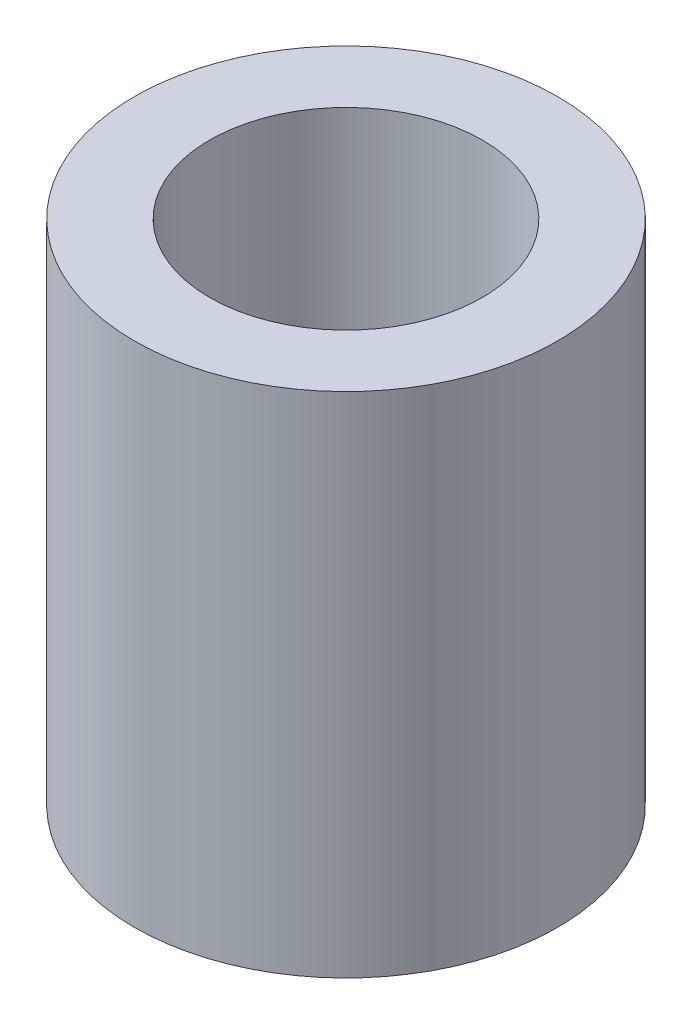
ISO-10303-21;
HEADER;
FILE_DESCRIPTION(('STEP AP214'),'2;1');
FILE_NAME('part.step','',(''),(''),'','','');
FILE_SCHEMA(('AUTOMOTIVE_DESIGN { 1 0 10303 214 1 1 1 1 }'));
ENDSEC;
DATA;
#1=APPLICATION_CONTEXT('core data for automotive mechanical design processes');
#2=APPLICATION_PROTOCOL_DEFINITION('international standard','automotive_design',2000,#1);
#3=PRODUCT_CONTEXT('',#1,'mechanical');
#4=PRODUCT('Part','Part','',(#3));
#5=PRODUCT_RELATED_PRODUCT_CATEGORY('part','',(#4));
#6=PRODUCT_DEFINITION_FORMATION('','',#4);
#7=PRODUCT_DEFINITION_CONTEXT('part definition',#1,'design');
#8=PRODUCT_DEFINITION('design','',#6,#7);
#9=PRODUCT_DEFINITION_SHAPE('','',#8);
#10=(LENGTH_UNIT() NAMED_UNIT(*) SI_UNIT(.MILLI.,.METRE.));
#11=(NAMED_UNIT(*) PLANE_ANGLE_UNIT() SI_UNIT($,.RADIAN.));
#12=(NAMED_UNIT(*) SI_UNIT($,.STERADIAN.) SOLID_ANGLE_UNIT());
#13=UNCERTAINTY_MEASURE_WITH_UNIT(LENGTH_MEASURE(1.E-05),#10,'distance_accuracy_value','');
#14=(GEOMETRIC_REPRESENTATION_CONTEXT(3) GLOBAL_UNCERTAINTY_ASSIGNED_CONTEXT((#13)) GLOBAL_UNIT_ASSIGNED_CONTEXT((#10,
#11,#12)) REPRESENTATION_CONTEXT('',''));
#15=CARTESIAN_POINT('',(0.,0.,0.));
#16=DIRECTION('',(0.,0.,1.));
#17=DIRECTION('',(1.,0.,0.));
#18=AXIS2_PLACEMENT_3D('',#15,#16,#17);
#19=CARTESIAN_POINT('',(0.,0.,0.));
#20=DIRECTION('',(0.,1.,0.));
#21=DIRECTION('',(0.,0.,1.));
#22=AXIS2_PLACEMENT_3D('',#19,#20,#21);
#23=CYLINDRICAL_SURFACE('',#22,2.3876);
#24=CARTESIAN_POINT('',(0.,0.,0.));
#25=DIRECTION('',(0.,1.,0.));
#26=DIRECTION('',(0.,0.,1.));
#27=AXIS2_PLACEMENT_3D('',#24,#25,#26);
#28=CIRCLE('',#27,2.3876);
#29=CARTESIAN_POINT('',(0.,0.,2.3876));
#30=VERTEX_POINT('',#29);
#31=EDGE_CURVE('E27',#30,#30,#28,.F.);
#32=ORIENTED_EDGE('',*,*,#31,.T.);
#33=EDGE_LOOP('',(#32));
#34=FACE_BOUND('',#33,.T.);
#35=CARTESIAN_POINT('',(0.,8.89,0.));
#36=DIRECTION('',(0.,1.,0.));
#37=DIRECTION('',(0.,0.,1.));
#38=AXIS2_PLACEMENT_3D('',#35,#36,#37);
#39=CIRCLE('',#38,2.3876);
#40=CARTESIAN_POINT('',(0.,8.89,2.3876));
#41=VERTEX_POINT('',#40);
#42=EDGE_CURVE('E18',#41,#41,#39,.F.);
#43=ORIENTED_EDGE('',*,*,#42,.F.);
#44=EDGE_LOOP('',(#43));
#45=FACE_BOUND('',#44,.T.);
#46=ADVANCED_FACE('F15',(#34,#45),#23,.F.);
#47=CARTESIAN_POINT('',(0.,8.89,0.));
#48=DIRECTION('',(0.,1.,0.));
#49=DIRECTION('',(0.,0.,1.));
#50=AXIS2_PLACEMENT_3D('',#47,#48,#49);
#51=PLANE('',#50);
#52=CARTESIAN_POINT('',(0.,8.89,0.));
#53=DIRECTION('',(0.,-1.,0.));
#54=DIRECTION('',(0.,0.,-1.));
#55=AXIS2_PLACEMENT_3D('',#52,#53,#54);
#56=CIRCLE('',#55,3.70459);
#57=CARTESIAN_POINT('',(0.,8.89,-3.70459));
#58=VERTEX_POINT('',#57);
#59=EDGE_CURVE('E22',#58,#58,#56,.T.);
#60=ORIENTED_EDGE('',*,*,#59,.F.);
#61=EDGE_LOOP('',(#60));
#62=FACE_BOUND('',#61,.T.);
#63=ORIENTED_EDGE('',*,*,#42,.T.);
#64=EDGE_LOOP('',(#63));
#65=FACE_BOUND('',#64,.T.);
#66=ADVANCED_FACE('F35',(#62,#65),#51,.T.);
#67=CARTESIAN_POINT('',(0.,0.,0.));
#68=DIRECTION('',(0.,1.,0.));
#69=DIRECTION('',(0.,0.,1.));
#70=AXIS2_PLACEMENT_3D('',#67,#68,#69);
#71=PLANE('',#70);
#72=CARTESIAN_POINT('',(0.,0.,0.));
#73=DIRECTION('',(0.,-1.,0.));
#74=DIRECTION('',(0.,0.,-1.));
#75=AXIS2_PLACEMENT_3D('',#72,#73,#74);
#76=CIRCLE('',#75,3.70459);
#77=CARTESIAN_POINT('',(0.,0.,-3.70459));
#78=VERTEX_POINT('',#77);
#79=EDGE_CURVE('E10',#78,#78,#76,.F.);
#80=ORIENTED_EDGE('',*,*,#79,.F.);
#81=EDGE_LOOP('',(#80));
#82=FACE_BOUND('',#81,.T.);
#83=ORIENTED_EDGE('',*,*,#31,.F.);
#84=EDGE_LOOP('',(#83));
#85=FACE_BOUND('',#84,.T.);
#86=ADVANCED_FACE('F42',(#82,#85),#71,.F.);
#87=CARTESIAN_POINT('',(0.,8.89,0.));
#88=DIRECTION('',(0.,-1.,0.));
#89=DIRECTION('',(0.,0.,-1.));
#90=AXIS2_PLACEMENT_3D('',#87,#88,#89);
#91=CYLINDRICAL_SURFACE('',#90,3.70459);
#92=ORIENTED_EDGE('',*,*,#79,.T.);
#93=EDGE_LOOP('',(#92));
#94=FACE_BOUND('',#93,.T.);
#95=ORIENTED_EDGE('',*,*,#59,.T.);
#96=EDGE_LOOP('',(#95));
#97=FACE_BOUND('',#96,.T.);
#98=ADVANCED_FACE('F44',(#94,#97),#91,.T.);
#99=CLOSED_SHELL('',(#46,#66,#86,#98));
#100=MANIFOLD_SOLID_BREP('B1',#99);
#101=ADVANCED_BREP_SHAPE_REPRESENTATION('',(#18,#100),#14);
#102=SHAPE_DEFINITION_REPRESENTATION(#9,#101);
ENDSEC;
END-ISO-10303-21;
